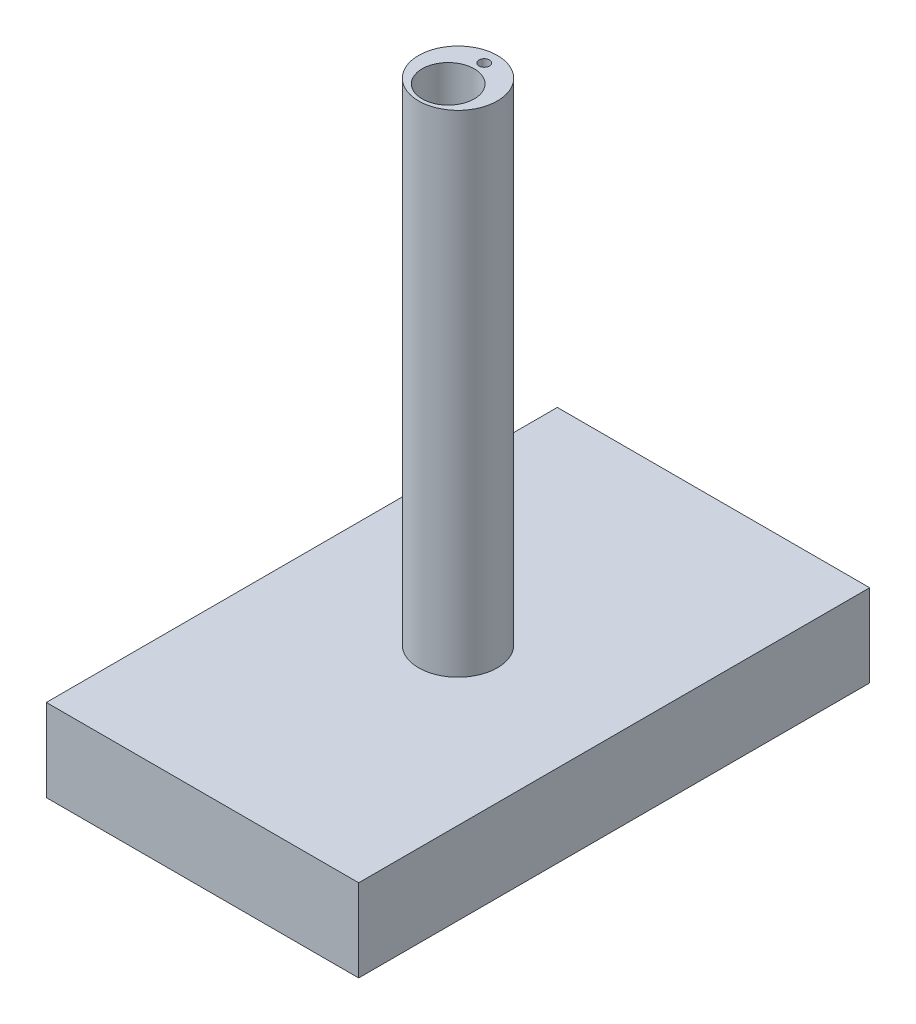
ISO-10303-21;
HEADER;
FILE_DESCRIPTION(('STEP AP214'),'2;1');
FILE_NAME('part.step','',(''),(''),'','','');
FILE_SCHEMA(('AUTOMOTIVE_DESIGN { 1 0 10303 214 1 1 1 1 }'));
ENDSEC;
DATA;
#1=APPLICATION_CONTEXT('core data for automotive mechanical design processes');
#2=APPLICATION_PROTOCOL_DEFINITION('international standard','automotive_design',2000,#1);
#3=PRODUCT_CONTEXT('',#1,'mechanical');
#4=PRODUCT('Part','Part','',(#3));
#5=PRODUCT_RELATED_PRODUCT_CATEGORY('part','',(#4));
#6=PRODUCT_DEFINITION_FORMATION('','',#4);
#7=PRODUCT_DEFINITION_CONTEXT('part definition',#1,'design');
#8=PRODUCT_DEFINITION('design','',#6,#7);
#9=PRODUCT_DEFINITION_SHAPE('','',#8);
#10=(LENGTH_UNIT() NAMED_UNIT(*) SI_UNIT(.MILLI.,.METRE.));
#11=(NAMED_UNIT(*) PLANE_ANGLE_UNIT() SI_UNIT($,.RADIAN.));
#12=(NAMED_UNIT(*) SI_UNIT($,.STERADIAN.) SOLID_ANGLE_UNIT());
#13=UNCERTAINTY_MEASURE_WITH_UNIT(LENGTH_MEASURE(1.E-05),#10,'distance_accuracy_value','');
#14=(GEOMETRIC_REPRESENTATION_CONTEXT(3) GLOBAL_UNCERTAINTY_ASSIGNED_CONTEXT((#13)) GLOBAL_UNIT_ASSIGNED_CONTEXT((#10,
#11,#12)) REPRESENTATION_CONTEXT('',''));
#15=CARTESIAN_POINT('',(0.,0.,0.));
#16=DIRECTION('',(0.,0.,1.));
#17=DIRECTION('',(1.,0.,0.));
#18=AXIS2_PLACEMENT_3D('',#15,#16,#17);
#19=CARTESIAN_POINT('',(0.,350.,0.));
#20=DIRECTION('',(0.,-1.,0.));
#21=DIRECTION('',(0.,0.,-1.));
#22=AXIS2_PLACEMENT_3D('',#19,#20,#21);
#23=CYLINDRICAL_SURFACE('',#22,28.1);
#24=CARTESIAN_POINT('',(0.,350.,0.));
#25=DIRECTION('',(0.,1.,0.));
#26=DIRECTION('',(0.,0.,1.));
#27=AXIS2_PLACEMENT_3D('',#24,#25,#26);
#28=CIRCLE('',#27,28.1);
#29=CARTESIAN_POINT('',(0.,350.,28.1));
#30=VERTEX_POINT('',#29);
#31=EDGE_CURVE('E11',#30,#30,#28,.T.);
#32=ORIENTED_EDGE('',*,*,#31,.F.);
#33=EDGE_LOOP('',(#32));
#34=FACE_BOUND('',#33,.T.);
#35=CARTESIAN_POINT('',(0.,0.,0.));
#36=DIRECTION('',(0.,1.,0.));
#37=DIRECTION('',(0.,0.,1.));
#38=AXIS2_PLACEMENT_3D('',#35,#36,#37);
#39=CIRCLE('',#38,28.1);
#40=CARTESIAN_POINT('',(0.,0.,28.1));
#41=VERTEX_POINT('',#40);
#42=EDGE_CURVE('E205',#41,#41,#39,.T.);
#43=ORIENTED_EDGE('',*,*,#42,.T.);
#44=EDGE_LOOP('',(#43));
#45=FACE_BOUND('',#44,.T.);
#46=ADVANCED_FACE('F39',(#34,#45),#23,.T.);
#47=CARTESIAN_POINT('',(0.,350.,0.));
#48=DIRECTION('',(0.,1.,0.));
#49=DIRECTION('',(0.,0.,1.));
#50=AXIS2_PLACEMENT_3D('',#47,#48,#49);
#51=PLANE('',#50);
#52=CARTESIAN_POINT('',(0.,350.,-18.75));
#53=DIRECTION('',(0.,1.,0.));
#54=DIRECTION('',(0.,0.,1.));
#55=AXIS2_PLACEMENT_3D('',#52,#53,#54);
#56=CIRCLE('',#55,3.75);
#57=CARTESIAN_POINT('',(0.,350.,-15.));
#58=VERTEX_POINT('',#57);
#59=EDGE_CURVE('E225',#58,#58,#56,.T.);
#60=ORIENTED_EDGE('',*,*,#59,.F.);
#61=EDGE_LOOP('',(#60));
#62=FACE_BOUND('',#61,.T.);
#63=CARTESIAN_POINT('',(0.,350.,7.));
#64=DIRECTION('',(0.,1.,0.));
#65=DIRECTION('',(0.,0.,1.));
#66=AXIS2_PLACEMENT_3D('',#63,#64,#65);
#67=CIRCLE('',#66,18.6);
#68=CARTESIAN_POINT('',(0.,350.,25.6));
#69=VERTEX_POINT('',#68);
#70=EDGE_CURVE('E209',#69,#69,#67,.T.);
#71=ORIENTED_EDGE('',*,*,#70,.F.);
#72=EDGE_LOOP('',(#71));
#73=FACE_BOUND('',#72,.T.);
#74=ORIENTED_EDGE('',*,*,#31,.T.);
#75=EDGE_LOOP('',(#74));
#76=FACE_BOUND('',#75,.T.);
#77=ADVANCED_FACE('F234',(#62,#73,#76),#51,.T.);
#78=CARTESIAN_POINT('',(0.,291.2,7.));
#79=DIRECTION('',(0.,1.,0.));
#80=DIRECTION('',(0.,0.,1.));
#81=AXIS2_PLACEMENT_3D('',#78,#79,#80);
#82=CYLINDRICAL_SURFACE('',#81,18.6);
#83=CARTESIAN_POINT('',(0.,291.2,7.));
#84=DIRECTION('',(0.,1.,0.));
#85=DIRECTION('',(0.,0.,1.));
#86=AXIS2_PLACEMENT_3D('',#83,#84,#85);
#87=CIRCLE('',#86,18.6);
#88=CARTESIAN_POINT('',(0.,291.2,25.6));
#89=VERTEX_POINT('',#88);
#90=EDGE_CURVE('E48',#89,#89,#87,.T.);
#91=ORIENTED_EDGE('',*,*,#90,.F.);
#92=EDGE_LOOP('',(#91));
#93=FACE_BOUND('',#92,.T.);
#94=ORIENTED_EDGE('',*,*,#70,.T.);
#95=EDGE_LOOP('',(#94));
#96=FACE_BOUND('',#95,.T.);
#97=ADVANCED_FACE('F237',(#93,#96),#82,.F.);
#98=CARTESIAN_POINT('',(0.,291.2,7.));
#99=DIRECTION('',(0.,1.,0.));
#100=DIRECTION('',(0.,0.,1.));
#101=AXIS2_PLACEMENT_3D('',#98,#99,#100);
#102=PLANE('',#101);
#103=CARTESIAN_POINT('',(0.,291.2,7.));
#104=DIRECTION('',(0.,1.,0.));
#105=DIRECTION('',(0.,0.,1.));
#106=AXIS2_PLACEMENT_3D('',#103,#104,#105);
#107=CIRCLE('',#106,16.1);
#108=CARTESIAN_POINT('',(0.,291.2,23.1));
#109=VERTEX_POINT('',#108);
#110=EDGE_CURVE('E146',#109,#109,#107,.T.);
#111=ORIENTED_EDGE('',*,*,#110,.F.);
#112=EDGE_LOOP('',(#111));
#113=FACE_BOUND('',#112,.T.);
#114=ORIENTED_EDGE('',*,*,#90,.T.);
#115=EDGE_LOOP('',(#114));
#116=FACE_BOUND('',#115,.T.);
#117=ADVANCED_FACE('F270',(#113,#116),#102,.T.);
#118=CARTESIAN_POINT('',(111.341546011374,-58.8,182.141376200391));
#119=DIRECTION('',(-1.,0.,0.));
#120=DIRECTION('',(0.,0.,1.));
#121=AXIS2_PLACEMENT_3D('',#118,#119,#120);
#122=PLANE('',#121);
#123=DIRECTION('',(0.,0.,1.));
#124=VECTOR('',#123,1.);
#125=CARTESIAN_POINT('',(111.341546011374,0.,182.141376200391));
#126=LINE('',#125,#124);
#127=CARTESIAN_POINT('',(111.341546011374,0.,-182.141376200391));
#128=VERTEX_POINT('',#127);
#129=CARTESIAN_POINT('',(111.341546011374,0.,182.141376200391));
#130=VERTEX_POINT('',#129);
#131=EDGE_CURVE('E165',#128,#130,#126,.T.);
#132=ORIENTED_EDGE('',*,*,#131,.T.);
#133=DIRECTION('',(0.,1.,0.));
#134=VECTOR('',#133,1.);
#135=CARTESIAN_POINT('',(111.341546011374,-58.8,182.141376200391));
#136=LINE('',#135,#134);
#137=CARTESIAN_POINT('',(111.341546011374,-58.8,182.141376200391));
#138=VERTEX_POINT('',#137);
#139=EDGE_CURVE('E202',#138,#130,#136,.T.);
#140=ORIENTED_EDGE('',*,*,#139,.F.);
#141=DIRECTION('',(0.,0.,1.));
#142=VECTOR('',#141,1.);
#143=CARTESIAN_POINT('',(111.341546011374,-58.8,182.141376200391));
#144=LINE('',#143,#142);
#145=CARTESIAN_POINT('',(111.341546011374,-58.8,-182.141376200391));
#146=VERTEX_POINT('',#145);
#147=EDGE_CURVE('E171',#146,#138,#144,.T.);
#148=ORIENTED_EDGE('',*,*,#147,.F.);
#149=DIRECTION('',(0.,1.,0.));
#150=VECTOR('',#149,1.);
#151=CARTESIAN_POINT('',(111.341546011374,-58.8,-182.141376200391));
#152=LINE('',#151,#150);
#153=EDGE_CURVE('E181',#146,#128,#152,.T.);
#154=ORIENTED_EDGE('',*,*,#153,.T.);
#155=EDGE_LOOP('',(#132,#140,#148,#154));
#156=FACE_BOUND('',#155,.T.);
#157=ADVANCED_FACE('F255',(#156),#122,.F.);
#158=CARTESIAN_POINT('',(-111.341546011374,-58.8,182.141376200391));
#159=DIRECTION('',(0.,0.,-1.));
#160=DIRECTION('',(-1.,0.,0.));
#161=AXIS2_PLACEMENT_3D('',#158,#159,#160);
#162=PLANE('',#161);
#163=DIRECTION('',(-1.,0.,0.));
#164=VECTOR('',#163,1.);
#165=CARTESIAN_POINT('',(-111.341546011374,0.,182.141376200391));
#166=LINE('',#165,#164);
#167=CARTESIAN_POINT('',(-111.341546011374,0.,182.141376200391));
#168=VERTEX_POINT('',#167);
#169=EDGE_CURVE('E185',#130,#168,#166,.T.);
#170=ORIENTED_EDGE('',*,*,#169,.T.);
#171=DIRECTION('',(0.,1.,0.));
#172=VECTOR('',#171,1.);
#173=CARTESIAN_POINT('',(-111.341546011374,-58.8,182.141376200391));
#174=LINE('',#173,#172);
#175=CARTESIAN_POINT('',(-111.341546011374,-58.8,182.141376200391));
#176=VERTEX_POINT('',#175);
#177=EDGE_CURVE('E198',#176,#168,#174,.T.);
#178=ORIENTED_EDGE('',*,*,#177,.F.);
#179=DIRECTION('',(-1.,0.,0.));
#180=VECTOR('',#179,1.);
#181=CARTESIAN_POINT('',(-111.341546011374,-58.8,182.141376200391));
#182=LINE('',#181,#180);
#183=EDGE_CURVE('E94',#138,#176,#182,.T.);
#184=ORIENTED_EDGE('',*,*,#183,.F.);
#185=ORIENTED_EDGE('',*,*,#139,.T.);
#186=EDGE_LOOP('',(#170,#178,#184,#185));
#187=FACE_BOUND('',#186,.T.);
#188=ADVANCED_FACE('F262',(#187),#162,.F.);
#189=CARTESIAN_POINT('',(-111.341546011374,-58.8,182.141376200391));
#190=DIRECTION('',(1.,0.,0.));
#191=DIRECTION('',(0.,0.,-1.));
#192=AXIS2_PLACEMENT_3D('',#189,#190,#191);
#193=PLANE('',#192);
#194=DIRECTION('',(0.,0.,-1.));
#195=VECTOR('',#194,1.);
#196=CARTESIAN_POINT('',(-111.341546011374,0.,182.141376200391));
#197=LINE('',#196,#195);
#198=CARTESIAN_POINT('',(-111.341546011374,0.,-182.141376200391));
#199=VERTEX_POINT('',#198);
#200=EDGE_CURVE('E188',#168,#199,#197,.T.);
#201=ORIENTED_EDGE('',*,*,#200,.T.);
#202=DIRECTION('',(0.,1.,0.));
#203=VECTOR('',#202,1.);
#204=CARTESIAN_POINT('',(-111.341546011374,-58.8,-182.141376200391));
#205=LINE('',#204,#203);
#206=CARTESIAN_POINT('',(-111.341546011374,-58.8,-182.141376200391));
#207=VERTEX_POINT('',#206);
#208=EDGE_CURVE('E195',#207,#199,#205,.T.);
#209=ORIENTED_EDGE('',*,*,#208,.F.);
#210=DIRECTION('',(0.,0.,-1.));
#211=VECTOR('',#210,1.);
#212=CARTESIAN_POINT('',(-111.341546011374,-58.8,182.141376200391));
#213=LINE('',#212,#211);
#214=EDGE_CURVE('E176',#176,#207,#213,.T.);
#215=ORIENTED_EDGE('',*,*,#214,.F.);
#216=ORIENTED_EDGE('',*,*,#177,.T.);
#217=EDGE_LOOP('',(#201,#209,#215,#216));
#218=FACE_BOUND('',#217,.T.);
#219=ADVANCED_FACE('F261',(#218),#193,.F.);
#220=CARTESIAN_POINT('',(-111.341546011374,-58.8,-182.141376200391));
#221=DIRECTION('',(0.,0.,1.));
#222=DIRECTION('',(1.,0.,0.));
#223=AXIS2_PLACEMENT_3D('',#220,#221,#222);
#224=PLANE('',#223);
#225=DIRECTION('',(1.,0.,0.));
#226=VECTOR('',#225,1.);
#227=CARTESIAN_POINT('',(-111.341546011374,0.,-182.141376200391));
#228=LINE('',#227,#226);
#229=EDGE_CURVE('E86',#199,#128,#228,.T.);
#230=ORIENTED_EDGE('',*,*,#229,.T.);
#231=ORIENTED_EDGE('',*,*,#153,.F.);
#232=DIRECTION('',(1.,0.,0.));
#233=VECTOR('',#232,1.);
#234=CARTESIAN_POINT('',(-111.341546011374,-58.8,-182.141376200391));
#235=LINE('',#234,#233);
#236=EDGE_CURVE('E65',#207,#146,#235,.T.);
#237=ORIENTED_EDGE('',*,*,#236,.F.);
#238=ORIENTED_EDGE('',*,*,#208,.T.);
#239=EDGE_LOOP('',(#230,#231,#237,#238));
#240=FACE_BOUND('',#239,.T.);
#241=ADVANCED_FACE('F257',(#240),#224,.F.);
#242=CARTESIAN_POINT('',(0.,-58.8,0.));
#243=DIRECTION('',(0.,-1.,0.));
#244=DIRECTION('',(0.,0.,-1.));
#245=AXIS2_PLACEMENT_3D('',#242,#243,#244);
#246=PLANE('',#245);
#247=DIRECTION('',(0.,0.,1.));
#248=VECTOR('',#247,1.);
#249=CARTESIAN_POINT('',(103.958701758156,-58.8,174.272148859892));
#250=LINE('',#249,#248);
#251=CARTESIAN_POINT('',(103.958701758156,-58.8,-174.272148859892));
#252=VERTEX_POINT('',#251);
#253=CARTESIAN_POINT('',(103.958701758156,-58.8,174.272148859892));
#254=VERTEX_POINT('',#253);
#255=EDGE_CURVE('E56',#252,#254,#250,.T.);
#256=ORIENTED_EDGE('',*,*,#255,.F.);
#257=DIRECTION('',(1.,0.,0.));
#258=VECTOR('',#257,1.);
#259=CARTESIAN_POINT('',(-103.958701758156,-58.8,-174.272148859892));
#260=LINE('',#259,#258);
#261=CARTESIAN_POINT('',(-103.958701758156,-58.8,-174.272148859892));
#262=VERTEX_POINT('',#261);
#263=EDGE_CURVE('E139',#262,#252,#260,.T.);
#264=ORIENTED_EDGE('',*,*,#263,.F.);
#265=DIRECTION('',(0.,0.,-1.));
#266=VECTOR('',#265,1.);
#267=CARTESIAN_POINT('',(-103.958701758156,-58.8,174.272148859892));
#268=LINE('',#267,#266);
#269=CARTESIAN_POINT('',(-103.958701758156,-58.8,174.272148859892));
#270=VERTEX_POINT('',#269);
#271=EDGE_CURVE('E143',#270,#262,#268,.T.);
#272=ORIENTED_EDGE('',*,*,#271,.F.);
#273=DIRECTION('',(-1.,0.,0.));
#274=VECTOR('',#273,1.);
#275=CARTESIAN_POINT('',(-103.958701758156,-58.8,174.272148859892));
#276=LINE('',#275,#274);
#277=EDGE_CURVE('E155',#254,#270,#276,.T.);
#278=ORIENTED_EDGE('',*,*,#277,.F.);
#279=EDGE_LOOP('',(#256,#264,#272,#278));
#280=FACE_BOUND('',#279,.T.);
#281=ORIENTED_EDGE('',*,*,#147,.T.);
#282=ORIENTED_EDGE('',*,*,#183,.T.);
#283=ORIENTED_EDGE('',*,*,#214,.T.);
#284=ORIENTED_EDGE('',*,*,#236,.T.);
#285=EDGE_LOOP('',(#281,#282,#283,#284));
#286=FACE_BOUND('',#285,.T.);
#287=ADVANCED_FACE('F249',(#280,#286),#246,.T.);
#288=CARTESIAN_POINT('',(0.,0.,0.));
#289=DIRECTION('',(0.,-1.,0.));
#290=DIRECTION('',(0.,0.,-1.));
#291=AXIS2_PLACEMENT_3D('',#288,#289,#290);
#292=PLANE('',#291);
#293=ORIENTED_EDGE('',*,*,#42,.F.);
#294=EDGE_LOOP('',(#293));
#295=FACE_BOUND('',#294,.T.);
#296=ORIENTED_EDGE('',*,*,#131,.F.);
#297=ORIENTED_EDGE('',*,*,#229,.F.);
#298=ORIENTED_EDGE('',*,*,#200,.F.);
#299=ORIENTED_EDGE('',*,*,#169,.F.);
#300=EDGE_LOOP('',(#296,#297,#298,#299));
#301=FACE_BOUND('',#300,.T.);
#302=ADVANCED_FACE('F246',(#295,#301),#292,.F.);
#303=CARTESIAN_POINT('',(103.958701758156,-10.,174.272148859892));
#304=DIRECTION('',(1.,0.,0.));
#305=DIRECTION('',(0.,0.,-1.));
#306=AXIS2_PLACEMENT_3D('',#303,#304,#305);
#307=PLANE('',#306);
#308=ORIENTED_EDGE('',*,*,#255,.T.);
#309=DIRECTION('',(0.,-1.,0.));
#310=VECTOR('',#309,1.);
#311=CARTESIAN_POINT('',(103.958701758156,-10.,174.272148859892));
#312=LINE('',#311,#310);
#313=CARTESIAN_POINT('',(103.958701758156,-10.,174.272148859892));
#314=VERTEX_POINT('',#313);
#315=EDGE_CURVE('E114',#314,#254,#312,.T.);
#316=ORIENTED_EDGE('',*,*,#315,.F.);
#317=DIRECTION('',(0.,0.,1.));
#318=VECTOR('',#317,1.);
#319=CARTESIAN_POINT('',(103.958701758156,-10.,174.272148859892));
#320=LINE('',#319,#318);
#321=CARTESIAN_POINT('',(103.958701758156,-10.,-174.272148859892));
#322=VERTEX_POINT('',#321);
#323=EDGE_CURVE('E118',#322,#314,#320,.T.);
#324=ORIENTED_EDGE('',*,*,#323,.F.);
#325=DIRECTION('',(0.,-1.,0.));
#326=VECTOR('',#325,1.);
#327=CARTESIAN_POINT('',(103.958701758156,-10.,-174.272148859892));
#328=LINE('',#327,#326);
#329=EDGE_CURVE('E162',#322,#252,#328,.T.);
#330=ORIENTED_EDGE('',*,*,#329,.T.);
#331=EDGE_LOOP('',(#308,#316,#324,#330));
#332=FACE_BOUND('',#331,.T.);
#333=ADVANCED_FACE('F116',(#332),#307,.F.);
#334=CARTESIAN_POINT('',(-103.958701758156,-10.,-174.272148859892));
#335=DIRECTION('',(0.,0.,-1.));
#336=DIRECTION('',(-1.,0.,0.));
#337=AXIS2_PLACEMENT_3D('',#334,#335,#336);
#338=PLANE('',#337);
#339=ORIENTED_EDGE('',*,*,#263,.T.);
#340=ORIENTED_EDGE('',*,*,#329,.F.);
#341=DIRECTION('',(1.,0.,0.));
#342=VECTOR('',#341,1.);
#343=CARTESIAN_POINT('',(-103.958701758156,-10.,-174.272148859892));
#344=LINE('',#343,#342);
#345=CARTESIAN_POINT('',(-103.958701758156,-10.,-174.272148859892));
#346=VERTEX_POINT('',#345);
#347=EDGE_CURVE('E125',#346,#322,#344,.T.);
#348=ORIENTED_EDGE('',*,*,#347,.F.);
#349=DIRECTION('',(0.,-1.,0.));
#350=VECTOR('',#349,1.);
#351=CARTESIAN_POINT('',(-103.958701758156,-10.,-174.272148859892));
#352=LINE('',#351,#350);
#353=EDGE_CURVE('E166',#346,#262,#352,.T.);
#354=ORIENTED_EDGE('',*,*,#353,.T.);
#355=EDGE_LOOP('',(#339,#340,#348,#354));
#356=FACE_BOUND('',#355,.T.);
#357=ADVANCED_FACE('F338',(#356),#338,.F.);
#358=CARTESIAN_POINT('',(-103.958701758156,-10.,174.272148859892));
#359=DIRECTION('',(-1.,0.,0.));
#360=DIRECTION('',(0.,0.,1.));
#361=AXIS2_PLACEMENT_3D('',#358,#359,#360);
#362=PLANE('',#361);
#363=ORIENTED_EDGE('',*,*,#271,.T.);
#364=ORIENTED_EDGE('',*,*,#353,.F.);
#365=DIRECTION('',(0.,0.,-1.));
#366=VECTOR('',#365,1.);
#367=CARTESIAN_POINT('',(-103.958701758156,-10.,174.272148859892));
#368=LINE('',#367,#366);
#369=CARTESIAN_POINT('',(-103.958701758156,-10.,174.272148859892));
#370=VERTEX_POINT('',#369);
#371=EDGE_CURVE('E134',#370,#346,#368,.T.);
#372=ORIENTED_EDGE('',*,*,#371,.F.);
#373=DIRECTION('',(0.,-1.,0.));
#374=VECTOR('',#373,1.);
#375=CARTESIAN_POINT('',(-103.958701758156,-10.,174.272148859892));
#376=LINE('',#375,#374);
#377=EDGE_CURVE('E124',#370,#270,#376,.T.);
#378=ORIENTED_EDGE('',*,*,#377,.T.);
#379=EDGE_LOOP('',(#363,#364,#372,#378));
#380=FACE_BOUND('',#379,.T.);
#381=ADVANCED_FACE('F347',(#380),#362,.F.);
#382=CARTESIAN_POINT('',(-103.958701758156,-10.,174.272148859892));
#383=DIRECTION('',(0.,0.,1.));
#384=DIRECTION('',(1.,0.,0.));
#385=AXIS2_PLACEMENT_3D('',#382,#383,#384);
#386=PLANE('',#385);
#387=ORIENTED_EDGE('',*,*,#277,.T.);
#388=ORIENTED_EDGE('',*,*,#377,.F.);
#389=DIRECTION('',(-1.,0.,0.));
#390=VECTOR('',#389,1.);
#391=CARTESIAN_POINT('',(-103.958701758156,-10.,174.272148859892));
#392=LINE('',#391,#390);
#393=EDGE_CURVE('E128',#314,#370,#392,.T.);
#394=ORIENTED_EDGE('',*,*,#393,.F.);
#395=ORIENTED_EDGE('',*,*,#315,.T.);
#396=EDGE_LOOP('',(#387,#388,#394,#395));
#397=FACE_BOUND('',#396,.T.);
#398=ADVANCED_FACE('F129',(#397),#386,.F.);
#399=CARTESIAN_POINT('',(0.,-10.,0.));
#400=DIRECTION('',(0.,-1.,0.));
#401=DIRECTION('',(0.,0.,-1.));
#402=AXIS2_PLACEMENT_3D('',#399,#400,#401);
#403=PLANE('',#402);
#404=CARTESIAN_POINT('',(0.,-10.,-18.75));
#405=DIRECTION('',(0.,-1.,0.));
#406=DIRECTION('',(0.,0.,-1.));
#407=AXIS2_PLACEMENT_3D('',#404,#405,#406);
#408=CIRCLE('',#407,3.75);
#409=CARTESIAN_POINT('',(0.,-10.,-22.5));
#410=VERTEX_POINT('',#409);
#411=EDGE_CURVE('E42',#410,#410,#408,.T.);
#412=ORIENTED_EDGE('',*,*,#411,.F.);
#413=EDGE_LOOP('',(#412));
#414=FACE_BOUND('',#413,.T.);
#415=CARTESIAN_POINT('',(0.,-10.,7.));
#416=DIRECTION('',(0.,-1.,0.));
#417=DIRECTION('',(0.,0.,-1.));
#418=AXIS2_PLACEMENT_3D('',#415,#416,#417);
#419=CIRCLE('',#418,16.1);
#420=CARTESIAN_POINT('',(0.,-10.,-9.1));
#421=VERTEX_POINT('',#420);
#422=EDGE_CURVE('E156',#421,#421,#419,.T.);
#423=ORIENTED_EDGE('',*,*,#422,.F.);
#424=EDGE_LOOP('',(#423));
#425=FACE_BOUND('',#424,.T.);
#426=ORIENTED_EDGE('',*,*,#323,.T.);
#427=ORIENTED_EDGE('',*,*,#393,.T.);
#428=ORIENTED_EDGE('',*,*,#371,.T.);
#429=ORIENTED_EDGE('',*,*,#347,.T.);
#430=EDGE_LOOP('',(#426,#427,#428,#429));
#431=FACE_BOUND('',#430,.T.);
#432=ADVANCED_FACE('F136',(#414,#425,#431),#403,.T.);
#433=CARTESIAN_POINT('',(0.,-58.8,7.));
#434=DIRECTION('',(0.,1.,0.));
#435=DIRECTION('',(0.,0.,1.));
#436=AXIS2_PLACEMENT_3D('',#433,#434,#435);
#437=CYLINDRICAL_SURFACE('',#436,16.1);
#438=ORIENTED_EDGE('',*,*,#422,.T.);
#439=EDGE_LOOP('',(#438));
#440=FACE_BOUND('',#439,.T.);
#441=ORIENTED_EDGE('',*,*,#110,.T.);
#442=EDGE_LOOP('',(#441));
#443=FACE_BOUND('',#442,.T.);
#444=ADVANCED_FACE('F373',(#440,#443),#437,.F.);
#445=CARTESIAN_POINT('',(0.,-50.,-18.75));
#446=DIRECTION('',(0.,1.,0.));
#447=DIRECTION('',(0.,0.,1.));
#448=AXIS2_PLACEMENT_3D('',#445,#446,#447);
#449=CYLINDRICAL_SURFACE('',#448,3.75);
#450=ORIENTED_EDGE('',*,*,#411,.T.);
#451=EDGE_LOOP('',(#450));
#452=FACE_BOUND('',#451,.T.);
#453=ORIENTED_EDGE('',*,*,#59,.T.);
#454=EDGE_LOOP('',(#453));
#455=FACE_BOUND('',#454,.T.);
#456=ADVANCED_FACE('F232',(#452,#455),#449,.F.);
#457=CLOSED_SHELL('',(#46,#77,#97,#117,#157,#188,#219,#241,#287,#302,#333,#357,#381,#398,#432,
#444,#456));
#458=MANIFOLD_SOLID_BREP('B2',#457);
#459=ADVANCED_BREP_SHAPE_REPRESENTATION('',(#18,#458),#14);
#460=SHAPE_DEFINITION_REPRESENTATION(#9,#459);
ENDSEC;
END-ISO-10303-21;
